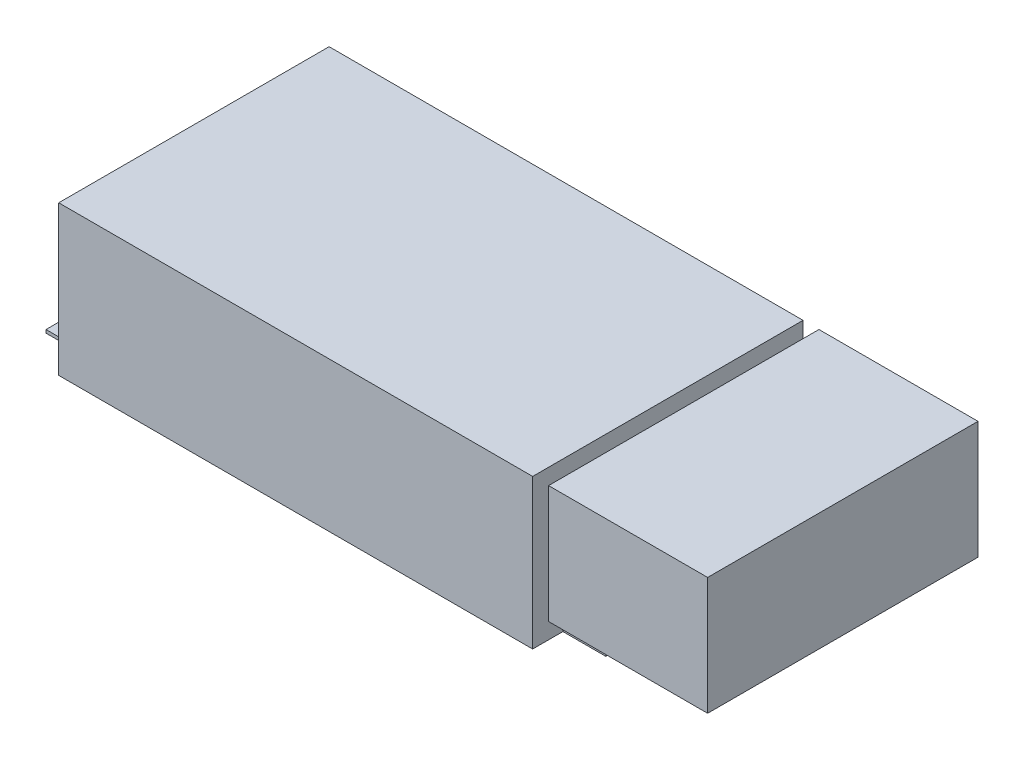
ISO-10303-21;
HEADER;
FILE_DESCRIPTION(('STEP AP214'),'2;1');
FILE_NAME('part.step','',(''),(''),'','','');
FILE_SCHEMA(('AUTOMOTIVE_DESIGN { 1 0 10303 214 1 1 1 1 }'));
ENDSEC;
DATA;
#1=APPLICATION_CONTEXT('core data for automotive mechanical design processes');
#2=APPLICATION_PROTOCOL_DEFINITION('international standard','automotive_design',2000,#1);
#3=PRODUCT_CONTEXT('',#1,'mechanical');
#4=PRODUCT('Part','Part','',(#3));
#5=PRODUCT_RELATED_PRODUCT_CATEGORY('part','',(#4));
#6=PRODUCT_DEFINITION_FORMATION('','',#4);
#7=PRODUCT_DEFINITION_CONTEXT('part definition',#1,'design');
#8=PRODUCT_DEFINITION('design','',#6,#7);
#9=PRODUCT_DEFINITION_SHAPE('','',#8);
#10=(LENGTH_UNIT() NAMED_UNIT(*) SI_UNIT(.MILLI.,.METRE.));
#11=(NAMED_UNIT(*) PLANE_ANGLE_UNIT() SI_UNIT($,.RADIAN.));
#12=(NAMED_UNIT(*) SI_UNIT($,.STERADIAN.) SOLID_ANGLE_UNIT());
#13=UNCERTAINTY_MEASURE_WITH_UNIT(LENGTH_MEASURE(1.E-05),#10,'distance_accuracy_value','');
#14=(GEOMETRIC_REPRESENTATION_CONTEXT(3) GLOBAL_UNCERTAINTY_ASSIGNED_CONTEXT((#13)) GLOBAL_UNIT_ASSIGNED_CONTEXT((#10,
#11,#12)) REPRESENTATION_CONTEXT('',''));
#15=CARTESIAN_POINT('',(0.,0.,0.));
#16=DIRECTION('',(0.,0.,1.));
#17=DIRECTION('',(1.,0.,0.));
#18=AXIS2_PLACEMENT_3D('',#15,#16,#17);
#19=CARTESIAN_POINT('',(129.5,47.,-42.5));
#20=DIRECTION('',(0.,0.,1.));
#21=DIRECTION('',(0.,-1.,0.));
#22=AXIS2_PLACEMENT_3D('',#19,#20,#21);
#23=PLANE('',#22);
#24=DIRECTION('',(0.,1.,0.));
#25=VECTOR('',#24,1.);
#26=CARTESIAN_POINT('',(79.5,47.,-42.5));
#27=LINE('',#26,#25);
#28=CARTESIAN_POINT('',(79.5,10.,-42.5));
#29=VERTEX_POINT('',#28);
#30=CARTESIAN_POINT('',(79.5,47.,-42.5));
#31=VERTEX_POINT('',#30);
#32=EDGE_CURVE('E111',#29,#31,#27,.T.);
#33=ORIENTED_EDGE('',*,*,#32,.T.);
#34=DIRECTION('',(-1.,0.,0.));
#35=VECTOR('',#34,1.);
#36=CARTESIAN_POINT('',(129.5,47.,-42.5));
#37=LINE('',#36,#35);
#38=CARTESIAN_POINT('',(129.5,47.,-42.5));
#39=VERTEX_POINT('',#38);
#40=EDGE_CURVE('E12',#39,#31,#37,.T.);
#41=ORIENTED_EDGE('',*,*,#40,.F.);
#42=DIRECTION('',(0.,1.,0.));
#43=VECTOR('',#42,1.);
#44=CARTESIAN_POINT('',(129.5,47.,-42.5));
#45=LINE('',#44,#43);
#46=CARTESIAN_POINT('',(129.5,10.,-42.5));
#47=VERTEX_POINT('',#46);
#48=EDGE_CURVE('E99',#47,#39,#45,.T.);
#49=ORIENTED_EDGE('',*,*,#48,.F.);
#50=DIRECTION('',(-1.,0.,0.));
#51=VECTOR('',#50,1.);
#52=CARTESIAN_POINT('',(129.5,10.,-42.5));
#53=LINE('',#52,#51);
#54=EDGE_CURVE('E107',#47,#29,#53,.T.);
#55=ORIENTED_EDGE('',*,*,#54,.T.);
#56=EDGE_LOOP('',(#33,#41,#49,#55));
#57=FACE_BOUND('',#56,.T.);
#58=ADVANCED_FACE('F48',(#57),#23,.F.);
#59=CARTESIAN_POINT('',(129.5,47.,-42.5));
#60=DIRECTION('',(0.,-1.,0.));
#61=DIRECTION('',(0.,0.,-1.));
#62=AXIS2_PLACEMENT_3D('',#59,#60,#61);
#63=PLANE('',#62);
#64=DIRECTION('',(0.,0.,1.));
#65=VECTOR('',#64,1.);
#66=CARTESIAN_POINT('',(79.5,47.,-42.5));
#67=LINE('',#66,#65);
#68=CARTESIAN_POINT('',(79.5,47.,42.5));
#69=VERTEX_POINT('',#68);
#70=EDGE_CURVE('E103',#31,#69,#67,.T.);
#71=ORIENTED_EDGE('',*,*,#70,.T.);
#72=DIRECTION('',(-1.,0.,0.));
#73=VECTOR('',#72,1.);
#74=CARTESIAN_POINT('',(129.5,47.,42.5));
#75=LINE('',#74,#73);
#76=CARTESIAN_POINT('',(129.5,47.,42.5));
#77=VERTEX_POINT('',#76);
#78=EDGE_CURVE('E56',#77,#69,#75,.T.);
#79=ORIENTED_EDGE('',*,*,#78,.F.);
#80=DIRECTION('',(0.,0.,1.));
#81=VECTOR('',#80,1.);
#82=CARTESIAN_POINT('',(129.5,47.,-42.5));
#83=LINE('',#82,#81);
#84=EDGE_CURVE('E94',#39,#77,#83,.T.);
#85=ORIENTED_EDGE('',*,*,#84,.F.);
#86=ORIENTED_EDGE('',*,*,#40,.T.);
#87=EDGE_LOOP('',(#71,#79,#85,#86));
#88=FACE_BOUND('',#87,.T.);
#89=ADVANCED_FACE('F102',(#88),#63,.F.);
#90=CARTESIAN_POINT('',(129.5,47.,42.5));
#91=DIRECTION('',(0.,0.,-1.));
#92=DIRECTION('',(-1.,0.,0.));
#93=AXIS2_PLACEMENT_3D('',#90,#91,#92);
#94=PLANE('',#93);
#95=DIRECTION('',(0.,-1.,0.));
#96=VECTOR('',#95,1.);
#97=CARTESIAN_POINT('',(79.5,47.,42.5));
#98=LINE('',#97,#96);
#99=CARTESIAN_POINT('',(79.5,9.99999999999999,42.5));
#100=VERTEX_POINT('',#99);
#101=EDGE_CURVE('E81',#69,#100,#98,.T.);
#102=ORIENTED_EDGE('',*,*,#101,.T.);
#103=DIRECTION('',(-1.,0.,0.));
#104=VECTOR('',#103,1.);
#105=CARTESIAN_POINT('',(129.5,9.99999999999999,42.5));
#106=LINE('',#105,#104);
#107=CARTESIAN_POINT('',(129.5,9.99999999999999,42.5));
#108=VERTEX_POINT('',#107);
#109=EDGE_CURVE('E104',#108,#100,#106,.T.);
#110=ORIENTED_EDGE('',*,*,#109,.F.);
#111=DIRECTION('',(0.,-1.,0.));
#112=VECTOR('',#111,1.);
#113=CARTESIAN_POINT('',(129.5,47.,42.5));
#114=LINE('',#113,#112);
#115=EDGE_CURVE('E97',#77,#108,#114,.T.);
#116=ORIENTED_EDGE('',*,*,#115,.F.);
#117=ORIENTED_EDGE('',*,*,#78,.T.);
#118=EDGE_LOOP('',(#102,#110,#116,#117));
#119=FACE_BOUND('',#118,.T.);
#120=ADVANCED_FACE('F105',(#119),#94,.F.);
#121=CARTESIAN_POINT('',(129.5,10.,-42.5));
#122=DIRECTION('',(0.,1.,0.));
#123=DIRECTION('',(0.,0.,1.));
#124=AXIS2_PLACEMENT_3D('',#121,#122,#123);
#125=PLANE('',#124);
#126=DIRECTION('',(0.,0.,-1.));
#127=VECTOR('',#126,1.);
#128=CARTESIAN_POINT('',(79.5,10.,-42.5));
#129=LINE('',#128,#127);
#130=EDGE_CURVE('E87',#100,#29,#129,.T.);
#131=ORIENTED_EDGE('',*,*,#130,.T.);
#132=ORIENTED_EDGE('',*,*,#54,.F.);
#133=DIRECTION('',(0.,0.,-1.));
#134=VECTOR('',#133,1.);
#135=CARTESIAN_POINT('',(129.5,10.,-42.5));
#136=LINE('',#135,#134);
#137=EDGE_CURVE('E64',#108,#47,#136,.T.);
#138=ORIENTED_EDGE('',*,*,#137,.F.);
#139=ORIENTED_EDGE('',*,*,#109,.T.);
#140=EDGE_LOOP('',(#131,#132,#138,#139));
#141=FACE_BOUND('',#140,.T.);
#142=ADVANCED_FACE('F118',(#141),#125,.F.);
#143=CARTESIAN_POINT('',(129.5,0.,0.));
#144=DIRECTION('',(-1.,0.,0.));
#145=DIRECTION('',(0.,0.,1.));
#146=AXIS2_PLACEMENT_3D('',#143,#144,#145);
#147=PLANE('',#146);
#148=ORIENTED_EDGE('',*,*,#48,.T.);
#149=ORIENTED_EDGE('',*,*,#84,.T.);
#150=ORIENTED_EDGE('',*,*,#115,.T.);
#151=ORIENTED_EDGE('',*,*,#137,.T.);
#152=EDGE_LOOP('',(#148,#149,#150,#151));
#153=FACE_BOUND('',#152,.T.);
#154=ADVANCED_FACE('F95',(#153),#147,.F.);
#155=CARTESIAN_POINT('',(79.5,0.,0.));
#156=DIRECTION('',(-1.,0.,0.));
#157=DIRECTION('',(0.,0.,1.));
#158=AXIS2_PLACEMENT_3D('',#155,#156,#157);
#159=PLANE('',#158);
#160=ORIENTED_EDGE('',*,*,#32,.F.);
#161=ORIENTED_EDGE('',*,*,#130,.F.);
#162=ORIENTED_EDGE('',*,*,#101,.F.);
#163=ORIENTED_EDGE('',*,*,#70,.F.);
#164=EDGE_LOOP('',(#160,#161,#162,#163));
#165=FACE_BOUND('',#164,.T.);
#166=ADVANCED_FACE('F121',(#165),#159,.T.);
#167=CLOSED_SHELL('',(#58,#89,#120,#142,#154,#166));
#168=MANIFOLD_SOLID_BREP('B2',#167);
#169=CARTESIAN_POINT('',(74.5,47.,42.5));
#170=DIRECTION('',(-1.,0.,0.));
#171=DIRECTION('',(0.,0.,1.));
#172=AXIS2_PLACEMENT_3D('',#169,#170,#171);
#173=PLANE('',#172);
#174=DIRECTION('',(0.,0.,-1.));
#175=VECTOR('',#174,1.);
#176=CARTESIAN_POINT('',(74.5,1.,42.5));
#177=LINE('',#176,#175);
#178=CARTESIAN_POINT('',(74.5,1.,33.));
#179=VERTEX_POINT('',#178);
#180=CARTESIAN_POINT('',(74.5,1.,-33.));
#181=VERTEX_POINT('',#180);
#182=EDGE_CURVE('E185',#179,#181,#177,.T.);
#183=ORIENTED_EDGE('',*,*,#182,.T.);
#184=DIRECTION('',(0.,-1.,0.));
#185=VECTOR('',#184,1.);
#186=CARTESIAN_POINT('',(74.5,47.,-33.));
#187=LINE('',#186,#185);
#188=CARTESIAN_POINT('',(74.5,0.,-33.));
#189=VERTEX_POINT('',#188);
#190=EDGE_CURVE('E548',#181,#189,#187,.T.);
#191=ORIENTED_EDGE('',*,*,#190,.T.);
#192=DIRECTION('',(0.,0.,-1.));
#193=VECTOR('',#192,1.);
#194=CARTESIAN_POINT('',(74.5,0.,42.5));
#195=LINE('',#194,#193);
#196=CARTESIAN_POINT('',(74.5,0.,-42.5));
#197=VERTEX_POINT('',#196);
#198=EDGE_CURVE('E551',#189,#197,#195,.T.);
#199=ORIENTED_EDGE('',*,*,#198,.T.);
#200=DIRECTION('',(0.,-1.,0.));
#201=VECTOR('',#200,1.);
#202=CARTESIAN_POINT('',(74.5,47.,-42.5));
#203=LINE('',#202,#201);
#204=CARTESIAN_POINT('',(74.5,47.,-42.5));
#205=VERTEX_POINT('',#204);
#206=EDGE_CURVE('E178',#205,#197,#203,.T.);
#207=ORIENTED_EDGE('',*,*,#206,.F.);
#208=DIRECTION('',(0.,0.,-1.));
#209=VECTOR('',#208,1.);
#210=CARTESIAN_POINT('',(74.5,47.,42.5));
#211=LINE('',#210,#209);
#212=CARTESIAN_POINT('',(74.5,47.,42.5));
#213=VERTEX_POINT('',#212);
#214=EDGE_CURVE('E552',#213,#205,#211,.T.);
#215=ORIENTED_EDGE('',*,*,#214,.F.);
#216=DIRECTION('',(0.,-1.,0.));
#217=VECTOR('',#216,1.);
#218=CARTESIAN_POINT('',(74.5,47.,42.5));
#219=LINE('',#218,#217);
#220=CARTESIAN_POINT('',(74.5,0.,42.5));
#221=VERTEX_POINT('',#220);
#222=EDGE_CURVE('E562',#213,#221,#219,.T.);
#223=ORIENTED_EDGE('',*,*,#222,.T.);
#224=CARTESIAN_POINT('',(74.5,0.,33.));
#225=VERTEX_POINT('',#224);
#226=EDGE_CURVE('E563',#221,#225,#195,.T.);
#227=ORIENTED_EDGE('',*,*,#226,.T.);
#228=DIRECTION('',(0.,1.,0.));
#229=VECTOR('',#228,1.);
#230=CARTESIAN_POINT('',(74.5,47.,33.));
#231=LINE('',#230,#229);
#232=EDGE_CURVE('E190',#225,#179,#231,.T.);
#233=ORIENTED_EDGE('',*,*,#232,.T.);
#234=EDGE_LOOP('',(#183,#191,#199,#207,#215,#223,#227,#233));
#235=FACE_BOUND('',#234,.T.);
#236=ADVANCED_FACE('F171',(#235),#173,.F.);
#237=CARTESIAN_POINT('',(-74.5,47.,-42.5));
#238=DIRECTION('',(0.,0.,1.));
#239=DIRECTION('',(1.,0.,0.));
#240=AXIS2_PLACEMENT_3D('',#237,#238,#239);
#241=PLANE('',#240);
#242=DIRECTION('',(-1.,0.,0.));
#243=VECTOR('',#242,1.);
#244=CARTESIAN_POINT('',(-74.5,0.,-42.5));
#245=LINE('',#244,#243);
#246=CARTESIAN_POINT('',(-74.5,0.,-42.5));
#247=VERTEX_POINT('',#246);
#248=EDGE_CURVE('E565',#197,#247,#245,.T.);
#249=ORIENTED_EDGE('',*,*,#248,.T.);
#250=DIRECTION('',(0.,-1.,0.));
#251=VECTOR('',#250,1.);
#252=CARTESIAN_POINT('',(-74.5,47.,-42.5));
#253=LINE('',#252,#251);
#254=CARTESIAN_POINT('',(-74.5,47.,-42.5));
#255=VERTEX_POINT('',#254);
#256=EDGE_CURVE('E576',#255,#247,#253,.T.);
#257=ORIENTED_EDGE('',*,*,#256,.F.);
#258=DIRECTION('',(-1.,0.,0.));
#259=VECTOR('',#258,1.);
#260=CARTESIAN_POINT('',(-74.5,47.,-42.5));
#261=LINE('',#260,#259);
#262=EDGE_CURVE('E555',#205,#255,#261,.T.);
#263=ORIENTED_EDGE('',*,*,#262,.F.);
#264=ORIENTED_EDGE('',*,*,#206,.T.);
#265=EDGE_LOOP('',(#249,#257,#263,#264));
#266=FACE_BOUND('',#265,.T.);
#267=ADVANCED_FACE('F581',(#266),#241,.F.);
#268=CARTESIAN_POINT('',(-74.5,47.,42.5));
#269=DIRECTION('',(1.,0.,0.));
#270=DIRECTION('',(0.,0.,-1.));
#271=AXIS2_PLACEMENT_3D('',#268,#269,#270);
#272=PLANE('',#271);
#273=DIRECTION('',(0.,0.,1.));
#274=VECTOR('',#273,1.);
#275=CARTESIAN_POINT('',(-74.5,0.,42.5));
#276=LINE('',#275,#274);
#277=CARTESIAN_POINT('',(-74.5,0.,-33.));
#278=VERTEX_POINT('',#277);
#279=EDGE_CURVE('E568',#247,#278,#276,.T.);
#280=ORIENTED_EDGE('',*,*,#279,.T.);
#281=DIRECTION('',(0.,1.,0.));
#282=VECTOR('',#281,1.);
#283=CARTESIAN_POINT('',(-74.5,47.,-33.));
#284=LINE('',#283,#282);
#285=CARTESIAN_POINT('',(-74.5,1.,-33.));
#286=VERTEX_POINT('',#285);
#287=EDGE_CURVE('E546',#278,#286,#284,.T.);
#288=ORIENTED_EDGE('',*,*,#287,.T.);
#289=DIRECTION('',(0.,0.,1.));
#290=VECTOR('',#289,1.);
#291=CARTESIAN_POINT('',(-74.5,1.,42.5));
#292=LINE('',#291,#290);
#293=CARTESIAN_POINT('',(-74.5,1.,33.));
#294=VERTEX_POINT('',#293);
#295=EDGE_CURVE('E46',#286,#294,#292,.T.);
#296=ORIENTED_EDGE('',*,*,#295,.T.);
#297=DIRECTION('',(0.,-1.,0.));
#298=VECTOR('',#297,1.);
#299=CARTESIAN_POINT('',(-74.5,47.,33.));
#300=LINE('',#299,#298);
#301=CARTESIAN_POINT('',(-74.5,0.,33.));
#302=VERTEX_POINT('',#301);
#303=EDGE_CURVE('E536',#294,#302,#300,.T.);
#304=ORIENTED_EDGE('',*,*,#303,.T.);
#305=CARTESIAN_POINT('',(-74.5,0.,42.5));
#306=VERTEX_POINT('',#305);
#307=EDGE_CURVE('E567',#302,#306,#276,.T.);
#308=ORIENTED_EDGE('',*,*,#307,.T.);
#309=DIRECTION('',(0.,-1.,0.));
#310=VECTOR('',#309,1.);
#311=CARTESIAN_POINT('',(-74.5,47.,42.5));
#312=LINE('',#311,#310);
#313=CARTESIAN_POINT('',(-74.5,47.,42.5));
#314=VERTEX_POINT('',#313);
#315=EDGE_CURVE('E573',#314,#306,#312,.T.);
#316=ORIENTED_EDGE('',*,*,#315,.F.);
#317=DIRECTION('',(0.,0.,1.));
#318=VECTOR('',#317,1.);
#319=CARTESIAN_POINT('',(-74.5,47.,42.5));
#320=LINE('',#319,#318);
#321=EDGE_CURVE('E558',#255,#314,#320,.T.);
#322=ORIENTED_EDGE('',*,*,#321,.F.);
#323=ORIENTED_EDGE('',*,*,#256,.T.);
#324=EDGE_LOOP('',(#280,#288,#296,#304,#308,#316,#322,#323));
#325=FACE_BOUND('',#324,.T.);
#326=ADVANCED_FACE('F593',(#325),#272,.F.);
#327=CARTESIAN_POINT('',(-74.5,47.,42.5));
#328=DIRECTION('',(0.,0.,-1.));
#329=DIRECTION('',(-1.,0.,0.));
#330=AXIS2_PLACEMENT_3D('',#327,#328,#329);
#331=PLANE('',#330);
#332=DIRECTION('',(1.,0.,0.));
#333=VECTOR('',#332,1.);
#334=CARTESIAN_POINT('',(-74.5,0.,42.5));
#335=LINE('',#334,#333);
#336=EDGE_CURVE('E556',#306,#221,#335,.T.);
#337=ORIENTED_EDGE('',*,*,#336,.T.);
#338=ORIENTED_EDGE('',*,*,#222,.F.);
#339=DIRECTION('',(1.,0.,0.));
#340=VECTOR('',#339,1.);
#341=CARTESIAN_POINT('',(-74.5,47.,42.5));
#342=LINE('',#341,#340);
#343=EDGE_CURVE('E560',#314,#213,#342,.T.);
#344=ORIENTED_EDGE('',*,*,#343,.F.);
#345=ORIENTED_EDGE('',*,*,#315,.T.);
#346=EDGE_LOOP('',(#337,#338,#344,#345));
#347=FACE_BOUND('',#346,.T.);
#348=ADVANCED_FACE('F614',(#347),#331,.F.);
#349=CARTESIAN_POINT('',(0.,47.,0.));
#350=DIRECTION('',(0.,-1.,0.));
#351=DIRECTION('',(0.,0.,-1.));
#352=AXIS2_PLACEMENT_3D('',#349,#350,#351);
#353=PLANE('',#352);
#354=ORIENTED_EDGE('',*,*,#214,.T.);
#355=ORIENTED_EDGE('',*,*,#262,.T.);
#356=ORIENTED_EDGE('',*,*,#321,.T.);
#357=ORIENTED_EDGE('',*,*,#343,.T.);
#358=EDGE_LOOP('',(#354,#355,#356,#357));
#359=FACE_BOUND('',#358,.T.);
#360=ADVANCED_FACE('F617',(#359),#353,.F.);
#361=CARTESIAN_POINT('',(0.,0.,0.));
#362=DIRECTION('',(0.,-1.,0.));
#363=DIRECTION('',(0.,0.,-1.));
#364=AXIS2_PLACEMENT_3D('',#361,#362,#363);
#365=PLANE('',#364);
#366=ORIENTED_EDGE('',*,*,#307,.F.);
#367=DIRECTION('',(-1.,0.,0.));
#368=VECTOR('',#367,1.);
#369=CARTESIAN_POINT('',(-88.,0.,33.));
#370=LINE('',#369,#368);
#371=CARTESIAN_POINT('',(-88.,0.,33.));
#372=VERTEX_POINT('',#371);
#373=EDGE_CURVE('E523',#302,#372,#370,.T.);
#374=ORIENTED_EDGE('',*,*,#373,.T.);
#375=DIRECTION('',(0.,0.,-1.));
#376=VECTOR('',#375,1.);
#377=CARTESIAN_POINT('',(-88.,0.,-33.));
#378=LINE('',#377,#376);
#379=CARTESIAN_POINT('',(-88.,0.,-33.));
#380=VERTEX_POINT('',#379);
#381=EDGE_CURVE('E527',#372,#380,#378,.T.);
#382=ORIENTED_EDGE('',*,*,#381,.T.);
#383=DIRECTION('',(1.,0.,0.));
#384=VECTOR('',#383,1.);
#385=CARTESIAN_POINT('',(-88.,0.,-33.));
#386=LINE('',#385,#384);
#387=EDGE_CURVE('E509',#380,#278,#386,.T.);
#388=ORIENTED_EDGE('',*,*,#387,.T.);
#389=ORIENTED_EDGE('',*,*,#279,.F.);
#390=ORIENTED_EDGE('',*,*,#248,.F.);
#391=ORIENTED_EDGE('',*,*,#198,.F.);
#392=CARTESIAN_POINT('',(88.,0.,-33.));
#393=VERTEX_POINT('',#392);
#394=EDGE_CURVE('E530',#189,#393,#386,.T.);
#395=ORIENTED_EDGE('',*,*,#394,.T.);
#396=DIRECTION('',(0.,0.,1.));
#397=VECTOR('',#396,1.);
#398=CARTESIAN_POINT('',(88.,0.,-33.));
#399=LINE('',#398,#397);
#400=CARTESIAN_POINT('',(88.,0.,33.));
#401=VERTEX_POINT('',#400);
#402=EDGE_CURVE('E502',#393,#401,#399,.T.);
#403=ORIENTED_EDGE('',*,*,#402,.T.);
#404=EDGE_CURVE('E524',#401,#225,#370,.T.);
#405=ORIENTED_EDGE('',*,*,#404,.T.);
#406=ORIENTED_EDGE('',*,*,#226,.F.);
#407=ORIENTED_EDGE('',*,*,#336,.F.);
#408=EDGE_LOOP('',(#366,#374,#382,#388,#389,#390,#391,#395,#403,#405,#406,#407));
#409=FACE_BOUND('',#408,.T.);
#410=CARTESIAN_POINT('',(-81.5,0.,0.));
#411=DIRECTION('',(0.,-1.,0.));
#412=DIRECTION('',(0.,0.,-1.));
#413=AXIS2_PLACEMENT_3D('',#410,#411,#412);
#414=CIRCLE('',#413,3.50000000000001);
#415=CARTESIAN_POINT('',(-81.5,0.,-3.50000000000001));
#416=VERTEX_POINT('',#415);
#417=EDGE_CURVE('E496',#416,#416,#414,.T.);
#418=ORIENTED_EDGE('',*,*,#417,.F.);
#419=EDGE_LOOP('',(#418));
#420=FACE_BOUND('',#419,.T.);
#421=DIRECTION('',(0.,0.,-1.));
#422=VECTOR('',#421,1.);
#423=CARTESIAN_POINT('',(-85.,0.,24.));
#424=LINE('',#423,#422);
#425=CARTESIAN_POINT('',(-85.,0.,24.));
#426=VERTEX_POINT('',#425);
#427=CARTESIAN_POINT('',(-85.,0.,18.));
#428=VERTEX_POINT('',#427);
#429=EDGE_CURVE('E476',#426,#428,#424,.T.);
#430=ORIENTED_EDGE('',*,*,#429,.F.);
#431=CARTESIAN_POINT('',(-81.5,0.,24.));
#432=DIRECTION('',(0.,-1.,0.));
#433=DIRECTION('',(0.,0.,-1.));
#434=AXIS2_PLACEMENT_3D('',#431,#432,#433);
#435=CIRCLE('',#434,3.49999999999999);
#436=CARTESIAN_POINT('',(-78.,0.,24.));
#437=VERTEX_POINT('',#436);
#438=EDGE_CURVE('E454',#437,#426,#435,.T.);
#439=ORIENTED_EDGE('',*,*,#438,.F.);
#440=DIRECTION('',(0.,0.,1.));
#441=VECTOR('',#440,1.);
#442=CARTESIAN_POINT('',(-78.,0.,24.));
#443=LINE('',#442,#441);
#444=CARTESIAN_POINT('',(-78.,0.,18.));
#445=VERTEX_POINT('',#444);
#446=EDGE_CURVE('E465',#445,#437,#443,.T.);
#447=ORIENTED_EDGE('',*,*,#446,.F.);
#448=CARTESIAN_POINT('',(-81.5,0.,18.));
#449=DIRECTION('',(0.,-1.,0.));
#450=DIRECTION('',(0.,0.,-1.));
#451=AXIS2_PLACEMENT_3D('',#448,#449,#450);
#452=CIRCLE('',#451,3.5);
#453=EDGE_CURVE('E479',#428,#445,#452,.T.);
#454=ORIENTED_EDGE('',*,*,#453,.F.);
#455=EDGE_LOOP('',(#430,#439,#447,#454));
#456=FACE_BOUND('',#455,.T.);
#457=DIRECTION('',(0.,0.,1.));
#458=VECTOR('',#457,1.);
#459=CARTESIAN_POINT('',(-78.,0.,-24.));
#460=LINE('',#459,#458);
#461=CARTESIAN_POINT('',(-78.,0.,-24.));
#462=VERTEX_POINT('',#461);
#463=CARTESIAN_POINT('',(-78.,0.,-18.));
#464=VERTEX_POINT('',#463);
#465=EDGE_CURVE('E444',#462,#464,#460,.T.);
#466=ORIENTED_EDGE('',*,*,#465,.F.);
#467=CARTESIAN_POINT('',(-81.5,0.,-24.));
#468=DIRECTION('',(0.,-1.,0.));
#469=DIRECTION('',(0.,0.,1.));
#470=AXIS2_PLACEMENT_3D('',#467,#468,#469);
#471=CIRCLE('',#470,3.49999999999999);
#472=CARTESIAN_POINT('',(-85.,0.,-24.));
#473=VERTEX_POINT('',#472);
#474=EDGE_CURVE('E422',#473,#462,#471,.T.);
#475=ORIENTED_EDGE('',*,*,#474,.F.);
#476=DIRECTION('',(0.,0.,-1.));
#477=VECTOR('',#476,1.);
#478=CARTESIAN_POINT('',(-85.,0.,-24.));
#479=LINE('',#478,#477);
#480=CARTESIAN_POINT('',(-85.,0.,-18.));
#481=VERTEX_POINT('',#480);
#482=EDGE_CURVE('E433',#481,#473,#479,.T.);
#483=ORIENTED_EDGE('',*,*,#482,.F.);
#484=CARTESIAN_POINT('',(-81.5,0.,-18.));
#485=DIRECTION('',(0.,-1.,0.));
#486=DIRECTION('',(0.,0.,1.));
#487=AXIS2_PLACEMENT_3D('',#484,#485,#486);
#488=CIRCLE('',#487,3.5);
#489=EDGE_CURVE('E447',#464,#481,#488,.T.);
#490=ORIENTED_EDGE('',*,*,#489,.F.);
#491=EDGE_LOOP('',(#466,#475,#483,#490));
#492=FACE_BOUND('',#491,.T.);
#493=DIRECTION('',(0.,0.,1.));
#494=VECTOR('',#493,1.);
#495=CARTESIAN_POINT('',(85.0000000000001,0.,-23.9999999999993));
#496=LINE('',#495,#494);
#497=CARTESIAN_POINT('',(85.0000000000001,0.,-23.9999999999993));
#498=VERTEX_POINT('',#497);
#499=CARTESIAN_POINT('',(85.0000000000001,0.,-17.9999999999993));
#500=VERTEX_POINT('',#499);
#501=EDGE_CURVE('E387',#498,#500,#496,.T.);
#502=ORIENTED_EDGE('',*,*,#501,.F.);
#503=CARTESIAN_POINT('',(81.5000000000002,0.,-23.9999999999993));
#504=DIRECTION('',(0.,-1.,0.));
#505=DIRECTION('',(0.,0.,-1.));
#506=AXIS2_PLACEMENT_3D('',#503,#504,#505);
#507=CIRCLE('',#506,3.49999999999999);
#508=CARTESIAN_POINT('',(78.0000000000002,0.,-23.9999999999996));
#509=VERTEX_POINT('',#508);
#510=EDGE_CURVE('E360',#509,#498,#507,.T.);
#511=ORIENTED_EDGE('',*,*,#510,.F.);
#512=DIRECTION('',(0.,0.,-1.));
#513=VECTOR('',#512,1.);
#514=CARTESIAN_POINT('',(78.0000000000002,0.,-23.9999999999996));
#515=LINE('',#514,#513);
#516=CARTESIAN_POINT('',(78.0000000000001,0.,-17.9999999999996));
#517=VERTEX_POINT('',#516);
#518=EDGE_CURVE('E378',#517,#509,#515,.T.);
#519=ORIENTED_EDGE('',*,*,#518,.F.);
#520=CARTESIAN_POINT('',(81.5000000000001,0.,-17.9999999999993));
#521=DIRECTION('',(0.,-1.,0.));
#522=DIRECTION('',(0.,0.,-1.));
#523=AXIS2_PLACEMENT_3D('',#520,#521,#522);
#524=CIRCLE('',#523,3.5);
#525=EDGE_CURVE('E381',#500,#517,#524,.T.);
#526=ORIENTED_EDGE('',*,*,#525,.F.);
#527=EDGE_LOOP('',(#502,#511,#519,#526));
#528=FACE_BOUND('',#527,.T.);
#529=DIRECTION('',(0.,0.,-1.));
#530=VECTOR('',#529,1.);
#531=CARTESIAN_POINT('',(77.9999999999998,0.,24.0000000000004));
#532=LINE('',#531,#530);
#533=CARTESIAN_POINT('',(77.9999999999998,0.,24.0000000000004));
#534=VERTEX_POINT('',#533);
#535=CARTESIAN_POINT('',(77.9999999999999,0.,18.0000000000005));
#536=VERTEX_POINT('',#535);
#537=EDGE_CURVE('E412',#534,#536,#532,.T.);
#538=ORIENTED_EDGE('',*,*,#537,.F.);
#539=CARTESIAN_POINT('',(81.4999999999998,0.,24.0000000000004));
#540=DIRECTION('',(0.,-1.,0.));
#541=DIRECTION('',(0.,0.,1.));
#542=AXIS2_PLACEMENT_3D('',#539,#540,#541);
#543=CIRCLE('',#542,3.49999999999999);
#544=CARTESIAN_POINT('',(84.9999999999998,0.,24.0000000000004));
#545=VERTEX_POINT('',#544);
#546=EDGE_CURVE('E393',#545,#534,#543,.T.);
#547=ORIENTED_EDGE('',*,*,#546,.F.);
#548=DIRECTION('',(0.,0.,1.));
#549=VECTOR('',#548,1.);
#550=CARTESIAN_POINT('',(84.9999999999998,0.,24.0000000000004));
#551=LINE('',#550,#549);
#552=CARTESIAN_POINT('',(84.9999999999999,0.,18.0000000000005));
#553=VERTEX_POINT('',#552);
#554=EDGE_CURVE('E401',#553,#545,#551,.T.);
#555=ORIENTED_EDGE('',*,*,#554,.F.);
#556=CARTESIAN_POINT('',(81.4999999999999,0.,18.0000000000005));
#557=DIRECTION('',(0.,-1.,0.));
#558=DIRECTION('',(0.,0.,1.));
#559=AXIS2_PLACEMENT_3D('',#556,#557,#558);
#560=CIRCLE('',#559,3.5);
#561=EDGE_CURVE('E415',#536,#553,#560,.T.);
#562=ORIENTED_EDGE('',*,*,#561,.F.);
#563=EDGE_LOOP('',(#538,#547,#555,#562));
#564=FACE_BOUND('',#563,.T.);
#565=CARTESIAN_POINT('',(81.5,0.,0.));
#566=DIRECTION('',(0.,-1.,0.));
#567=DIRECTION('',(0.,0.,-1.));
#568=AXIS2_PLACEMENT_3D('',#565,#566,#567);
#569=CIRCLE('',#568,3.50000000000001);
#570=CARTESIAN_POINT('',(81.5,0.,-3.50000000000001));
#571=VERTEX_POINT('',#570);
#572=EDGE_CURVE('E486',#571,#571,#569,.T.);
#573=ORIENTED_EDGE('',*,*,#572,.F.);
#574=EDGE_LOOP('',(#573));
#575=FACE_BOUND('',#574,.T.);
#576=ADVANCED_FACE('F588',(#409,#420,#456,#492,#528,#564,#575),#365,.T.);
#577=CARTESIAN_POINT('',(-88.,1.,-33.));
#578=DIRECTION('',(-1.,0.,0.));
#579=DIRECTION('',(0.,0.,1.));
#580=AXIS2_PLACEMENT_3D('',#577,#578,#579);
#581=PLANE('',#580);
#582=ORIENTED_EDGE('',*,*,#381,.F.);
#583=DIRECTION('',(0.,-1.,0.));
#584=VECTOR('',#583,1.);
#585=CARTESIAN_POINT('',(-88.,1.,33.));
#586=LINE('',#585,#584);
#587=CARTESIAN_POINT('',(-88.,1.,33.));
#588=VERTEX_POINT('',#587);
#589=EDGE_CURVE('E539',#588,#372,#586,.T.);
#590=ORIENTED_EDGE('',*,*,#589,.F.);
#591=DIRECTION('',(0.,0.,-1.));
#592=VECTOR('',#591,1.);
#593=CARTESIAN_POINT('',(-88.,1.,-33.));
#594=LINE('',#593,#592);
#595=CARTESIAN_POINT('',(-88.,1.,-33.));
#596=VERTEX_POINT('',#595);
#597=EDGE_CURVE('E513',#588,#596,#594,.T.);
#598=ORIENTED_EDGE('',*,*,#597,.T.);
#599=DIRECTION('',(0.,-1.,0.));
#600=VECTOR('',#599,1.);
#601=CARTESIAN_POINT('',(-88.,1.,-33.));
#602=LINE('',#601,#600);
#603=EDGE_CURVE('E537',#596,#380,#602,.T.);
#604=ORIENTED_EDGE('',*,*,#603,.T.);
#605=EDGE_LOOP('',(#582,#590,#598,#604));
#606=FACE_BOUND('',#605,.T.);
#607=ADVANCED_FACE('F624',(#606),#581,.T.);
#608=CARTESIAN_POINT('',(-81.5,1.,-18.));
#609=DIRECTION('',(0.,-1.,0.));
#610=DIRECTION('',(0.,0.,-1.));
#611=AXIS2_PLACEMENT_3D('',#608,#609,#610);
#612=CYLINDRICAL_SURFACE('',#611,3.5);
#613=ORIENTED_EDGE('',*,*,#489,.T.);
#614=DIRECTION('',(0.,-1.,0.));
#615=VECTOR('',#614,1.);
#616=CARTESIAN_POINT('',(-85.,1.,-18.));
#617=LINE('',#616,#615);
#618=CARTESIAN_POINT('',(-85.,1.,-18.));
#619=VERTEX_POINT('',#618);
#620=EDGE_CURVE('E455',#619,#481,#617,.T.);
#621=ORIENTED_EDGE('',*,*,#620,.F.);
#622=CARTESIAN_POINT('',(-81.5,1.,-18.));
#623=DIRECTION('',(0.,-1.,0.));
#624=DIRECTION('',(0.,0.,1.));
#625=AXIS2_PLACEMENT_3D('',#622,#623,#624);
#626=CIRCLE('',#625,3.5);
#627=CARTESIAN_POINT('',(-78.,1.,-18.));
#628=VERTEX_POINT('',#627);
#629=EDGE_CURVE('E436',#628,#619,#626,.T.);
#630=ORIENTED_EDGE('',*,*,#629,.F.);
#631=DIRECTION('',(0.,-1.,0.));
#632=VECTOR('',#631,1.);
#633=CARTESIAN_POINT('',(-78.,1.,-18.));
#634=LINE('',#633,#632);
#635=EDGE_CURVE('E457',#628,#464,#634,.T.);
#636=ORIENTED_EDGE('',*,*,#635,.T.);
#637=EDGE_LOOP('',(#613,#621,#630,#636));
#638=FACE_BOUND('',#637,.T.);
#639=ADVANCED_FACE('F674',(#638),#612,.F.);
#640=CARTESIAN_POINT('',(-85.,1.,-24.));
#641=DIRECTION('',(-1.,0.,0.));
#642=DIRECTION('',(0.,0.,1.));
#643=AXIS2_PLACEMENT_3D('',#640,#641,#642);
#644=PLANE('',#643);
#645=ORIENTED_EDGE('',*,*,#482,.T.);
#646=DIRECTION('',(0.,-1.,0.));
#647=VECTOR('',#646,1.);
#648=CARTESIAN_POINT('',(-85.,1.,-24.));
#649=LINE('',#648,#647);
#650=CARTESIAN_POINT('',(-85.,1.,-24.));
#651=VERTEX_POINT('',#650);
#652=EDGE_CURVE('E452',#651,#473,#649,.T.);
#653=ORIENTED_EDGE('',*,*,#652,.F.);
#654=DIRECTION('',(0.,0.,-1.));
#655=VECTOR('',#654,1.);
#656=CARTESIAN_POINT('',(-85.,1.,-24.));
#657=LINE('',#656,#655);
#658=EDGE_CURVE('E439',#619,#651,#657,.T.);
#659=ORIENTED_EDGE('',*,*,#658,.F.);
#660=ORIENTED_EDGE('',*,*,#620,.T.);
#661=EDGE_LOOP('',(#645,#653,#659,#660));
#662=FACE_BOUND('',#661,.T.);
#663=ADVANCED_FACE('F683',(#662),#644,.F.);
#664=CARTESIAN_POINT('',(-81.5,1.,-24.));
#665=DIRECTION('',(0.,-1.,0.));
#666=DIRECTION('',(0.,0.,-1.));
#667=AXIS2_PLACEMENT_3D('',#664,#665,#666);
#668=CYLINDRICAL_SURFACE('',#667,3.49999999999999);
#669=ORIENTED_EDGE('',*,*,#474,.T.);
#670=DIRECTION('',(0.,-1.,0.));
#671=VECTOR('',#670,1.);
#672=CARTESIAN_POINT('',(-78.,1.,-24.));
#673=LINE('',#672,#671);
#674=CARTESIAN_POINT('',(-78.,1.,-24.));
#675=VERTEX_POINT('',#674);
#676=EDGE_CURVE('E442',#675,#462,#673,.T.);
#677=ORIENTED_EDGE('',*,*,#676,.F.);
#678=CARTESIAN_POINT('',(-81.5,1.,-24.));
#679=DIRECTION('',(0.,-1.,0.));
#680=DIRECTION('',(0.,0.,1.));
#681=AXIS2_PLACEMENT_3D('',#678,#679,#680);
#682=CIRCLE('',#681,3.49999999999999);
#683=EDGE_CURVE('E429',#651,#675,#682,.T.);
#684=ORIENTED_EDGE('',*,*,#683,.F.);
#685=ORIENTED_EDGE('',*,*,#652,.T.);
#686=EDGE_LOOP('',(#669,#677,#684,#685));
#687=FACE_BOUND('',#686,.T.);
#688=ADVANCED_FACE('F692',(#687),#668,.F.);
#689=CARTESIAN_POINT('',(-78.,1.,-24.));
#690=DIRECTION('',(1.,0.,0.));
#691=DIRECTION('',(0.,0.,-1.));
#692=AXIS2_PLACEMENT_3D('',#689,#690,#691);
#693=PLANE('',#692);
#694=ORIENTED_EDGE('',*,*,#465,.T.);
#695=ORIENTED_EDGE('',*,*,#635,.F.);
#696=DIRECTION('',(0.,0.,1.));
#697=VECTOR('',#696,1.);
#698=CARTESIAN_POINT('',(-78.,1.,-24.));
#699=LINE('',#698,#697);
#700=EDGE_CURVE('E432',#675,#628,#699,.T.);
#701=ORIENTED_EDGE('',*,*,#700,.F.);
#702=ORIENTED_EDGE('',*,*,#676,.T.);
#703=EDGE_LOOP('',(#694,#695,#701,#702));
#704=FACE_BOUND('',#703,.T.);
#705=ADVANCED_FACE('F701',(#704),#693,.F.);
#706=CARTESIAN_POINT('',(-81.5,1.,18.));
#707=DIRECTION('',(0.,-1.,0.));
#708=DIRECTION('',(0.,0.,-1.));
#709=AXIS2_PLACEMENT_3D('',#706,#707,#708);
#710=CYLINDRICAL_SURFACE('',#709,3.5);
#711=ORIENTED_EDGE('',*,*,#453,.T.);
#712=DIRECTION('',(0.,-1.,0.));
#713=VECTOR('',#712,1.);
#714=CARTESIAN_POINT('',(-78.,1.,18.));
#715=LINE('',#714,#713);
#716=CARTESIAN_POINT('',(-78.,1.,18.));
#717=VERTEX_POINT('',#716);
#718=EDGE_CURVE('E487',#717,#445,#715,.T.);
#719=ORIENTED_EDGE('',*,*,#718,.F.);
#720=CARTESIAN_POINT('',(-81.5,1.,18.));
#721=DIRECTION('',(0.,-1.,0.));
#722=DIRECTION('',(0.,0.,-1.));
#723=AXIS2_PLACEMENT_3D('',#720,#721,#722);
#724=CIRCLE('',#723,3.5);
#725=CARTESIAN_POINT('',(-85.,1.,18.));
#726=VERTEX_POINT('',#725);
#727=EDGE_CURVE('E468',#726,#717,#724,.T.);
#728=ORIENTED_EDGE('',*,*,#727,.F.);
#729=DIRECTION('',(0.,-1.,0.));
#730=VECTOR('',#729,1.);
#731=CARTESIAN_POINT('',(-85.,1.,18.));
#732=LINE('',#731,#730);
#733=EDGE_CURVE('E489',#726,#428,#732,.T.);
#734=ORIENTED_EDGE('',*,*,#733,.T.);
#735=EDGE_LOOP('',(#711,#719,#728,#734));
#736=FACE_BOUND('',#735,.T.);
#737=ADVANCED_FACE('F710',(#736),#710,.F.);
#738=CARTESIAN_POINT('',(-78.,1.,24.));
#739=DIRECTION('',(1.,0.,0.));
#740=DIRECTION('',(0.,0.,-1.));
#741=AXIS2_PLACEMENT_3D('',#738,#739,#740);
#742=PLANE('',#741);
#743=ORIENTED_EDGE('',*,*,#446,.T.);
#744=DIRECTION('',(0.,-1.,0.));
#745=VECTOR('',#744,1.);
#746=CARTESIAN_POINT('',(-78.,1.,24.));
#747=LINE('',#746,#745);
#748=CARTESIAN_POINT('',(-78.,1.,24.));
#749=VERTEX_POINT('',#748);
#750=EDGE_CURVE('E484',#749,#437,#747,.T.);
#751=ORIENTED_EDGE('',*,*,#750,.F.);
#752=DIRECTION('',(0.,0.,1.));
#753=VECTOR('',#752,1.);
#754=CARTESIAN_POINT('',(-78.,1.,24.));
#755=LINE('',#754,#753);
#756=EDGE_CURVE('E471',#717,#749,#755,.T.);
#757=ORIENTED_EDGE('',*,*,#756,.F.);
#758=ORIENTED_EDGE('',*,*,#718,.T.);
#759=EDGE_LOOP('',(#743,#751,#757,#758));
#760=FACE_BOUND('',#759,.T.);
#761=ADVANCED_FACE('F719',(#760),#742,.F.);
#762=CARTESIAN_POINT('',(-81.5,1.,24.));
#763=DIRECTION('',(0.,-1.,0.));
#764=DIRECTION('',(0.,0.,-1.));
#765=AXIS2_PLACEMENT_3D('',#762,#763,#764);
#766=CYLINDRICAL_SURFACE('',#765,3.49999999999999);
#767=ORIENTED_EDGE('',*,*,#438,.T.);
#768=DIRECTION('',(0.,-1.,0.));
#769=VECTOR('',#768,1.);
#770=CARTESIAN_POINT('',(-85.,1.,24.));
#771=LINE('',#770,#769);
#772=CARTESIAN_POINT('',(-85.,1.,24.));
#773=VERTEX_POINT('',#772);
#774=EDGE_CURVE('E474',#773,#426,#771,.T.);
#775=ORIENTED_EDGE('',*,*,#774,.F.);
#776=CARTESIAN_POINT('',(-81.5,1.,24.));
#777=DIRECTION('',(0.,-1.,0.));
#778=DIRECTION('',(0.,0.,-1.));
#779=AXIS2_PLACEMENT_3D('',#776,#777,#778);
#780=CIRCLE('',#779,3.49999999999999);
#781=EDGE_CURVE('E461',#749,#773,#780,.T.);
#782=ORIENTED_EDGE('',*,*,#781,.F.);
#783=ORIENTED_EDGE('',*,*,#750,.T.);
#784=EDGE_LOOP('',(#767,#775,#782,#783));
#785=FACE_BOUND('',#784,.T.);
#786=ADVANCED_FACE('F728',(#785),#766,.F.);
#787=CARTESIAN_POINT('',(-85.,1.,24.));
#788=DIRECTION('',(-1.,0.,0.));
#789=DIRECTION('',(0.,0.,1.));
#790=AXIS2_PLACEMENT_3D('',#787,#788,#789);
#791=PLANE('',#790);
#792=ORIENTED_EDGE('',*,*,#429,.T.);
#793=ORIENTED_EDGE('',*,*,#733,.F.);
#794=DIRECTION('',(0.,0.,-1.));
#795=VECTOR('',#794,1.);
#796=CARTESIAN_POINT('',(-85.,1.,24.));
#797=LINE('',#796,#795);
#798=EDGE_CURVE('E464',#773,#726,#797,.T.);
#799=ORIENTED_EDGE('',*,*,#798,.F.);
#800=ORIENTED_EDGE('',*,*,#774,.T.);
#801=EDGE_LOOP('',(#792,#793,#799,#800));
#802=FACE_BOUND('',#801,.T.);
#803=ADVANCED_FACE('F737',(#802),#791,.F.);
#804=CARTESIAN_POINT('',(-81.5,1.,0.));
#805=DIRECTION('',(0.,-1.,0.));
#806=DIRECTION('',(0.,0.,-1.));
#807=AXIS2_PLACEMENT_3D('',#804,#805,#806);
#808=CYLINDRICAL_SURFACE('',#807,3.50000000000001);
#809=CARTESIAN_POINT('',(-81.5,1.,0.));
#810=DIRECTION('',(0.,-1.,0.));
#811=DIRECTION('',(0.,0.,-1.));
#812=AXIS2_PLACEMENT_3D('',#809,#810,#811);
#813=CIRCLE('',#812,3.50000000000001);
#814=CARTESIAN_POINT('',(-81.5,1.,-3.50000000000001));
#815=VERTEX_POINT('',#814);
#816=EDGE_CURVE('E499',#815,#815,#813,.T.);
#817=ORIENTED_EDGE('',*,*,#816,.F.);
#818=EDGE_LOOP('',(#817));
#819=FACE_BOUND('',#818,.T.);
#820=ORIENTED_EDGE('',*,*,#417,.T.);
#821=EDGE_LOOP('',(#820));
#822=FACE_BOUND('',#821,.T.);
#823=ADVANCED_FACE('F746',(#819,#822),#808,.F.);
#824=CARTESIAN_POINT('',(0.,1.,0.));
#825=DIRECTION('',(0.,1.,0.));
#826=DIRECTION('',(0.,0.,1.));
#827=AXIS2_PLACEMENT_3D('',#824,#825,#826);
#828=PLANE('',#827);
#829=ORIENTED_EDGE('',*,*,#816,.T.);
#830=EDGE_LOOP('',(#829));
#831=FACE_BOUND('',#830,.T.);
#832=ORIENTED_EDGE('',*,*,#781,.T.);
#833=ORIENTED_EDGE('',*,*,#798,.T.);
#834=ORIENTED_EDGE('',*,*,#727,.T.);
#835=ORIENTED_EDGE('',*,*,#756,.T.);
#836=EDGE_LOOP('',(#832,#833,#834,#835));
#837=FACE_BOUND('',#836,.T.);
#838=ORIENTED_EDGE('',*,*,#683,.T.);
#839=ORIENTED_EDGE('',*,*,#700,.T.);
#840=ORIENTED_EDGE('',*,*,#629,.T.);
#841=ORIENTED_EDGE('',*,*,#658,.T.);
#842=EDGE_LOOP('',(#838,#839,#840,#841));
#843=FACE_BOUND('',#842,.T.);
#844=ORIENTED_EDGE('',*,*,#295,.F.);
#845=DIRECTION('',(1.,0.,0.));
#846=VECTOR('',#845,1.);
#847=CARTESIAN_POINT('',(-88.,1.,-33.));
#848=LINE('',#847,#846);
#849=EDGE_CURVE('E517',#596,#286,#848,.T.);
#850=ORIENTED_EDGE('',*,*,#849,.F.);
#851=ORIENTED_EDGE('',*,*,#597,.F.);
#852=DIRECTION('',(-1.,0.,0.));
#853=VECTOR('',#852,1.);
#854=CARTESIAN_POINT('',(-88.,1.,33.));
#855=LINE('',#854,#853);
#856=EDGE_CURVE('E508',#294,#588,#855,.T.);
#857=ORIENTED_EDGE('',*,*,#856,.F.);
#858=EDGE_LOOP('',(#844,#850,#851,#857));
#859=FACE_BOUND('',#858,.T.);
#860=ADVANCED_FACE('F601',(#831,#837,#843,#859),#828,.T.);
#861=CARTESIAN_POINT('',(-88.,1.,33.));
#862=DIRECTION('',(0.,0.,1.));
#863=DIRECTION('',(1.,0.,0.));
#864=AXIS2_PLACEMENT_3D('',#861,#862,#863);
#865=PLANE('',#864);
#866=ORIENTED_EDGE('',*,*,#303,.F.);
#867=ORIENTED_EDGE('',*,*,#856,.T.);
#868=ORIENTED_EDGE('',*,*,#589,.T.);
#869=ORIENTED_EDGE('',*,*,#373,.F.);
#870=EDGE_LOOP('',(#866,#867,#868,#869));
#871=FACE_BOUND('',#870,.T.);
#872=ADVANCED_FACE('F606',(#871),#865,.T.);
#873=CARTESIAN_POINT('',(-88.,1.,-33.));
#874=DIRECTION('',(0.,0.,-1.));
#875=DIRECTION('',(-1.,0.,0.));
#876=AXIS2_PLACEMENT_3D('',#873,#874,#875);
#877=PLANE('',#876);
#878=ORIENTED_EDGE('',*,*,#287,.F.);
#879=ORIENTED_EDGE('',*,*,#387,.F.);
#880=ORIENTED_EDGE('',*,*,#603,.F.);
#881=ORIENTED_EDGE('',*,*,#849,.T.);
#882=EDGE_LOOP('',(#878,#879,#880,#881));
#883=FACE_BOUND('',#882,.T.);
#884=ADVANCED_FACE('F597',(#883),#877,.T.);
#885=CARTESIAN_POINT('',(81.5,1.,0.));
#886=DIRECTION('',(0.,-1.,0.));
#887=DIRECTION('',(0.,0.,-1.));
#888=AXIS2_PLACEMENT_3D('',#885,#886,#887);
#889=CIRCLE('',#888,3.50000000000001);
#890=CARTESIAN_POINT('',(81.5,1.,-3.50000000000001));
#891=VERTEX_POINT('',#890);
#892=EDGE_CURVE('E493',#891,#891,#889,.T.);
#893=ORIENTED_EDGE('',*,*,#892,.T.);
#894=EDGE_LOOP('',(#893));
#895=FACE_BOUND('',#894,.T.);
#896=CARTESIAN_POINT('',(81.4999999999998,1.,24.0000000000004));
#897=DIRECTION('',(0.,-1.,0.));
#898=DIRECTION('',(0.,0.,1.));
#899=AXIS2_PLACEMENT_3D('',#896,#897,#898);
#900=CIRCLE('',#899,3.49999999999999);
#901=CARTESIAN_POINT('',(84.9999999999998,1.,24.0000000000004));
#902=VERTEX_POINT('',#901);
#903=CARTESIAN_POINT('',(77.9999999999998,1.,24.0000000000004));
#904=VERTEX_POINT('',#903);
#905=EDGE_CURVE('E397',#902,#904,#900,.T.);
#906=ORIENTED_EDGE('',*,*,#905,.T.);
#907=DIRECTION('',(0.,0.,-1.));
#908=VECTOR('',#907,1.);
#909=CARTESIAN_POINT('',(77.9999999999998,1.,24.0000000000004));
#910=LINE('',#909,#908);
#911=CARTESIAN_POINT('',(77.9999999999999,1.,18.0000000000005));
#912=VERTEX_POINT('',#911);
#913=EDGE_CURVE('E400',#904,#912,#910,.T.);
#914=ORIENTED_EDGE('',*,*,#913,.T.);
#915=CARTESIAN_POINT('',(81.4999999999999,1.,18.0000000000005));
#916=DIRECTION('',(0.,-1.,0.));
#917=DIRECTION('',(0.,0.,1.));
#918=AXIS2_PLACEMENT_3D('',#915,#916,#917);
#919=CIRCLE('',#918,3.5);
#920=CARTESIAN_POINT('',(84.9999999999999,1.,18.0000000000005));
#921=VERTEX_POINT('',#920);
#922=EDGE_CURVE('E404',#912,#921,#919,.T.);
#923=ORIENTED_EDGE('',*,*,#922,.T.);
#924=DIRECTION('',(0.,0.,1.));
#925=VECTOR('',#924,1.);
#926=CARTESIAN_POINT('',(84.9999999999998,1.,24.0000000000004));
#927=LINE('',#926,#925);
#928=EDGE_CURVE('E407',#921,#902,#927,.T.);
#929=ORIENTED_EDGE('',*,*,#928,.T.);
#930=EDGE_LOOP('',(#906,#914,#923,#929));
#931=FACE_BOUND('',#930,.T.);
#932=CARTESIAN_POINT('',(81.5000000000002,1.,-23.9999999999993));
#933=DIRECTION('',(0.,-1.,0.));
#934=DIRECTION('',(0.,0.,-1.));
#935=AXIS2_PLACEMENT_3D('',#932,#933,#934);
#936=CIRCLE('',#935,3.49999999999999);
#937=CARTESIAN_POINT('',(78.0000000000002,1.,-23.9999999999996));
#938=VERTEX_POINT('',#937);
#939=CARTESIAN_POINT('',(85.0000000000001,1.,-23.9999999999993));
#940=VERTEX_POINT('',#939);
#941=EDGE_CURVE('E357',#938,#940,#936,.T.);
#942=ORIENTED_EDGE('',*,*,#941,.T.);
#943=DIRECTION('',(0.,0.,1.));
#944=VECTOR('',#943,1.);
#945=CARTESIAN_POINT('',(85.0000000000001,1.,-23.9999999999993));
#946=LINE('',#945,#944);
#947=CARTESIAN_POINT('',(85.0000000000001,1.,-17.9999999999993));
#948=VERTEX_POINT('',#947);
#949=EDGE_CURVE('E369',#940,#948,#946,.T.);
#950=ORIENTED_EDGE('',*,*,#949,.T.);
#951=CARTESIAN_POINT('',(81.5000000000001,1.,-17.9999999999993));
#952=DIRECTION('',(0.,-1.,0.));
#953=DIRECTION('',(0.,0.,-1.));
#954=AXIS2_PLACEMENT_3D('',#951,#952,#953);
#955=CIRCLE('',#954,3.5);
#956=CARTESIAN_POINT('',(78.0000000000001,1.,-17.9999999999996));
#957=VERTEX_POINT('',#956);
#958=EDGE_CURVE('E373',#948,#957,#955,.T.);
#959=ORIENTED_EDGE('',*,*,#958,.T.);
#960=DIRECTION('',(0.,0.,-1.));
#961=VECTOR('',#960,1.);
#962=CARTESIAN_POINT('',(78.0000000000002,1.,-23.9999999999996));
#963=LINE('',#962,#961);
#964=EDGE_CURVE('E365',#957,#938,#963,.T.);
#965=ORIENTED_EDGE('',*,*,#964,.T.);
#966=EDGE_LOOP('',(#942,#950,#959,#965));
#967=FACE_BOUND('',#966,.T.);
#968=ORIENTED_EDGE('',*,*,#182,.F.);
#969=CARTESIAN_POINT('',(88.,1.,33.));
#970=VERTEX_POINT('',#969);
#971=EDGE_CURVE('E510',#970,#179,#855,.T.);
#972=ORIENTED_EDGE('',*,*,#971,.F.);
#973=DIRECTION('',(0.,0.,1.));
#974=VECTOR('',#973,1.);
#975=CARTESIAN_POINT('',(88.,1.,-33.));
#976=LINE('',#975,#974);
#977=CARTESIAN_POINT('',(88.,1.,-33.));
#978=VERTEX_POINT('',#977);
#979=EDGE_CURVE('E505',#978,#970,#976,.T.);
#980=ORIENTED_EDGE('',*,*,#979,.F.);
#981=EDGE_CURVE('E516',#181,#978,#848,.T.);
#982=ORIENTED_EDGE('',*,*,#981,.F.);
#983=EDGE_LOOP('',(#968,#972,#980,#982));
#984=FACE_BOUND('',#983,.T.);
#985=ADVANCED_FACE('F375',(#895,#931,#967,#984),#828,.T.);
#986=ORIENTED_EDGE('',*,*,#190,.F.);
#987=ORIENTED_EDGE('',*,*,#981,.T.);
#988=DIRECTION('',(0.,-1.,0.));
#989=VECTOR('',#988,1.);
#990=CARTESIAN_POINT('',(88.,1.,-33.));
#991=LINE('',#990,#989);
#992=EDGE_CURVE('E533',#978,#393,#991,.T.);
#993=ORIENTED_EDGE('',*,*,#992,.T.);
#994=ORIENTED_EDGE('',*,*,#394,.F.);
#995=EDGE_LOOP('',(#986,#987,#993,#994));
#996=FACE_BOUND('',#995,.T.);
#997=ADVANCED_FACE('F780',(#996),#877,.T.);
#998=ORIENTED_EDGE('',*,*,#232,.F.);
#999=ORIENTED_EDGE('',*,*,#404,.F.);
#1000=DIRECTION('',(0.,-1.,0.));
#1001=VECTOR('',#1000,1.);
#1002=CARTESIAN_POINT('',(88.,1.,33.));
#1003=LINE('',#1002,#1001);
#1004=EDGE_CURVE('E520',#970,#401,#1003,.T.);
#1005=ORIENTED_EDGE('',*,*,#1004,.F.);
#1006=ORIENTED_EDGE('',*,*,#971,.T.);
#1007=EDGE_LOOP('',(#998,#999,#1005,#1006));
#1008=FACE_BOUND('',#1007,.T.);
#1009=ADVANCED_FACE('F772',(#1008),#865,.T.);
#1010=CARTESIAN_POINT('',(88.,1.,-33.));
#1011=DIRECTION('',(1.,0.,0.));
#1012=DIRECTION('',(0.,0.,-1.));
#1013=AXIS2_PLACEMENT_3D('',#1010,#1011,#1012);
#1014=PLANE('',#1013);
#1015=ORIENTED_EDGE('',*,*,#402,.F.);
#1016=ORIENTED_EDGE('',*,*,#992,.F.);
#1017=ORIENTED_EDGE('',*,*,#979,.T.);
#1018=ORIENTED_EDGE('',*,*,#1004,.T.);
#1019=EDGE_LOOP('',(#1015,#1016,#1017,#1018));
#1020=FACE_BOUND('',#1019,.T.);
#1021=ADVANCED_FACE('F801',(#1020),#1014,.T.);
#1022=CARTESIAN_POINT('',(81.5,1.,0.));
#1023=DIRECTION('',(0.,-1.,0.));
#1024=DIRECTION('',(0.,0.,-1.));
#1025=AXIS2_PLACEMENT_3D('',#1022,#1023,#1024);
#1026=CYLINDRICAL_SURFACE('',#1025,3.50000000000001);
#1027=ORIENTED_EDGE('',*,*,#892,.F.);
#1028=EDGE_LOOP('',(#1027));
#1029=FACE_BOUND('',#1028,.T.);
#1030=ORIENTED_EDGE('',*,*,#572,.T.);
#1031=EDGE_LOOP('',(#1030));
#1032=FACE_BOUND('',#1031,.T.);
#1033=ADVANCED_FACE('F809',(#1029,#1032),#1026,.F.);
#1034=CARTESIAN_POINT('',(81.4999999999998,1.,24.0000000000004));
#1035=DIRECTION('',(0.,-1.,0.));
#1036=DIRECTION('',(0.,0.,-1.));
#1037=AXIS2_PLACEMENT_3D('',#1034,#1035,#1036);
#1038=CYLINDRICAL_SURFACE('',#1037,3.49999999999999);
#1039=ORIENTED_EDGE('',*,*,#546,.T.);
#1040=DIRECTION('',(0.,-1.,0.));
#1041=VECTOR('',#1040,1.);
#1042=CARTESIAN_POINT('',(77.9999999999998,1.,24.0000000000004));
#1043=LINE('',#1042,#1041);
#1044=EDGE_CURVE('E410',#904,#534,#1043,.T.);
#1045=ORIENTED_EDGE('',*,*,#1044,.F.);
#1046=ORIENTED_EDGE('',*,*,#905,.F.);
#1047=DIRECTION('',(0.,-1.,0.));
#1048=VECTOR('',#1047,1.);
#1049=CARTESIAN_POINT('',(84.9999999999998,1.,24.0000000000004));
#1050=LINE('',#1049,#1048);
#1051=EDGE_CURVE('E420',#902,#545,#1050,.T.);
#1052=ORIENTED_EDGE('',*,*,#1051,.T.);
#1053=EDGE_LOOP('',(#1039,#1045,#1046,#1052));
#1054=FACE_BOUND('',#1053,.T.);
#1055=ADVANCED_FACE('F817',(#1054),#1038,.F.);
#1056=CARTESIAN_POINT('',(84.9999999999998,1.,24.0000000000004));
#1057=DIRECTION('',(1.,0.,0.));
#1058=DIRECTION('',(0.,0.,-1.));
#1059=AXIS2_PLACEMENT_3D('',#1056,#1057,#1058);
#1060=PLANE('',#1059);
#1061=ORIENTED_EDGE('',*,*,#554,.T.);
#1062=ORIENTED_EDGE('',*,*,#1051,.F.);
#1063=ORIENTED_EDGE('',*,*,#928,.F.);
#1064=DIRECTION('',(0.,-1.,0.));
#1065=VECTOR('',#1064,1.);
#1066=CARTESIAN_POINT('',(84.9999999999999,1.,18.0000000000005));
#1067=LINE('',#1066,#1065);
#1068=EDGE_CURVE('E423',#921,#553,#1067,.T.);
#1069=ORIENTED_EDGE('',*,*,#1068,.T.);
#1070=EDGE_LOOP('',(#1061,#1062,#1063,#1069));
#1071=FACE_BOUND('',#1070,.T.);
#1072=ADVANCED_FACE('F826',(#1071),#1060,.F.);
#1073=CARTESIAN_POINT('',(81.4999999999999,1.,18.0000000000005));
#1074=DIRECTION('',(0.,-1.,0.));
#1075=DIRECTION('',(0.,0.,-1.));
#1076=AXIS2_PLACEMENT_3D('',#1073,#1074,#1075);
#1077=CYLINDRICAL_SURFACE('',#1076,3.5);
#1078=ORIENTED_EDGE('',*,*,#561,.T.);
#1079=ORIENTED_EDGE('',*,*,#1068,.F.);
#1080=ORIENTED_EDGE('',*,*,#922,.F.);
#1081=DIRECTION('',(0.,-1.,0.));
#1082=VECTOR('',#1081,1.);
#1083=CARTESIAN_POINT('',(77.9999999999999,1.,18.0000000000005));
#1084=LINE('',#1083,#1082);
#1085=EDGE_CURVE('E425',#912,#536,#1084,.T.);
#1086=ORIENTED_EDGE('',*,*,#1085,.T.);
#1087=EDGE_LOOP('',(#1078,#1079,#1080,#1086));
#1088=FACE_BOUND('',#1087,.T.);
#1089=ADVANCED_FACE('F835',(#1088),#1077,.F.);
#1090=CARTESIAN_POINT('',(77.9999999999998,1.,24.0000000000004));
#1091=DIRECTION('',(-1.,0.,0.));
#1092=DIRECTION('',(0.,0.,1.));
#1093=AXIS2_PLACEMENT_3D('',#1090,#1091,#1092);
#1094=PLANE('',#1093);
#1095=ORIENTED_EDGE('',*,*,#537,.T.);
#1096=ORIENTED_EDGE('',*,*,#1085,.F.);
#1097=ORIENTED_EDGE('',*,*,#913,.F.);
#1098=ORIENTED_EDGE('',*,*,#1044,.T.);
#1099=EDGE_LOOP('',(#1095,#1096,#1097,#1098));
#1100=FACE_BOUND('',#1099,.T.);
#1101=ADVANCED_FACE('F844',(#1100),#1094,.F.);
#1102=CARTESIAN_POINT('',(81.5000000000002,1.,-23.9999999999993));
#1103=DIRECTION('',(0.,-1.,0.));
#1104=DIRECTION('',(0.,0.,-1.));
#1105=AXIS2_PLACEMENT_3D('',#1102,#1103,#1104);
#1106=CYLINDRICAL_SURFACE('',#1105,3.49999999999999);
#1107=ORIENTED_EDGE('',*,*,#510,.T.);
#1108=DIRECTION('',(0.,-1.,0.));
#1109=VECTOR('',#1108,1.);
#1110=CARTESIAN_POINT('',(85.0000000000001,1.,-23.9999999999993));
#1111=LINE('',#1110,#1109);
#1112=EDGE_CURVE('E353',#940,#498,#1111,.T.);
#1113=ORIENTED_EDGE('',*,*,#1112,.F.);
#1114=ORIENTED_EDGE('',*,*,#941,.F.);
#1115=DIRECTION('',(0.,-1.,0.));
#1116=VECTOR('',#1115,1.);
#1117=CARTESIAN_POINT('',(78.0000000000002,1.,-23.9999999999996));
#1118=LINE('',#1117,#1116);
#1119=EDGE_CURVE('E391',#938,#509,#1118,.T.);
#1120=ORIENTED_EDGE('',*,*,#1119,.T.);
#1121=EDGE_LOOP('',(#1107,#1113,#1114,#1120));
#1122=FACE_BOUND('',#1121,.T.);
#1123=ADVANCED_FACE('F355',(#1122),#1106,.F.);
#1124=CARTESIAN_POINT('',(78.0000000000002,1.,-23.9999999999996));
#1125=DIRECTION('',(-1.,0.,0.));
#1126=DIRECTION('',(0.,0.,1.));
#1127=AXIS2_PLACEMENT_3D('',#1124,#1125,#1126);
#1128=PLANE('',#1127);
#1129=ORIENTED_EDGE('',*,*,#518,.T.);
#1130=ORIENTED_EDGE('',*,*,#1119,.F.);
#1131=ORIENTED_EDGE('',*,*,#964,.F.);
#1132=DIRECTION('',(0.,-1.,0.));
#1133=VECTOR('',#1132,1.);
#1134=CARTESIAN_POINT('',(78.0000000000001,1.,-17.9999999999996));
#1135=LINE('',#1134,#1133);
#1136=EDGE_CURVE('E394',#957,#517,#1135,.T.);
#1137=ORIENTED_EDGE('',*,*,#1136,.T.);
#1138=EDGE_LOOP('',(#1129,#1130,#1131,#1137));
#1139=FACE_BOUND('',#1138,.T.);
#1140=ADVANCED_FACE('F861',(#1139),#1128,.F.);
#1141=CARTESIAN_POINT('',(81.5000000000001,1.,-17.9999999999993));
#1142=DIRECTION('',(0.,-1.,0.));
#1143=DIRECTION('',(0.,0.,-1.));
#1144=AXIS2_PLACEMENT_3D('',#1141,#1142,#1143);
#1145=CYLINDRICAL_SURFACE('',#1144,3.5);
#1146=ORIENTED_EDGE('',*,*,#525,.T.);
#1147=ORIENTED_EDGE('',*,*,#1136,.F.);
#1148=ORIENTED_EDGE('',*,*,#958,.F.);
#1149=DIRECTION('',(0.,-1.,0.));
#1150=VECTOR('',#1149,1.);
#1151=CARTESIAN_POINT('',(85.0000000000001,1.,-17.9999999999993));
#1152=LINE('',#1151,#1150);
#1153=EDGE_CURVE('E364',#948,#500,#1152,.T.);
#1154=ORIENTED_EDGE('',*,*,#1153,.T.);
#1155=EDGE_LOOP('',(#1146,#1147,#1148,#1154));
#1156=FACE_BOUND('',#1155,.T.);
#1157=ADVANCED_FACE('F869',(#1156),#1145,.F.);
#1158=CARTESIAN_POINT('',(85.0000000000001,1.,-23.9999999999993));
#1159=DIRECTION('',(1.,0.,0.));
#1160=DIRECTION('',(0.,0.,-1.));
#1161=AXIS2_PLACEMENT_3D('',#1158,#1159,#1160);
#1162=PLANE('',#1161);
#1163=ORIENTED_EDGE('',*,*,#501,.T.);
#1164=ORIENTED_EDGE('',*,*,#1153,.F.);
#1165=ORIENTED_EDGE('',*,*,#949,.F.);
#1166=ORIENTED_EDGE('',*,*,#1112,.T.);
#1167=EDGE_LOOP('',(#1163,#1164,#1165,#1166));
#1168=FACE_BOUND('',#1167,.T.);
#1169=ADVANCED_FACE('F370',(#1168),#1162,.F.);
#1170=CLOSED_SHELL('',(#236,#267,#326,#348,#360,#576,#607,#639,#663,#688,#705,#737,#761,#786,
#803,#823,#860,#872,#884,#985,#997,#1009,#1021,#1033,#1055,#1072,#1089,#1101,#1123,#1140,#1157,#1169));
#1171=MANIFOLD_SOLID_BREP('B6',#1170);
#1172=ADVANCED_BREP_SHAPE_REPRESENTATION('',(#18,#168,#1171),#14);
#1173=SHAPE_DEFINITION_REPRESENTATION(#9,#1172);
ENDSEC;
END-ISO-10303-21;
